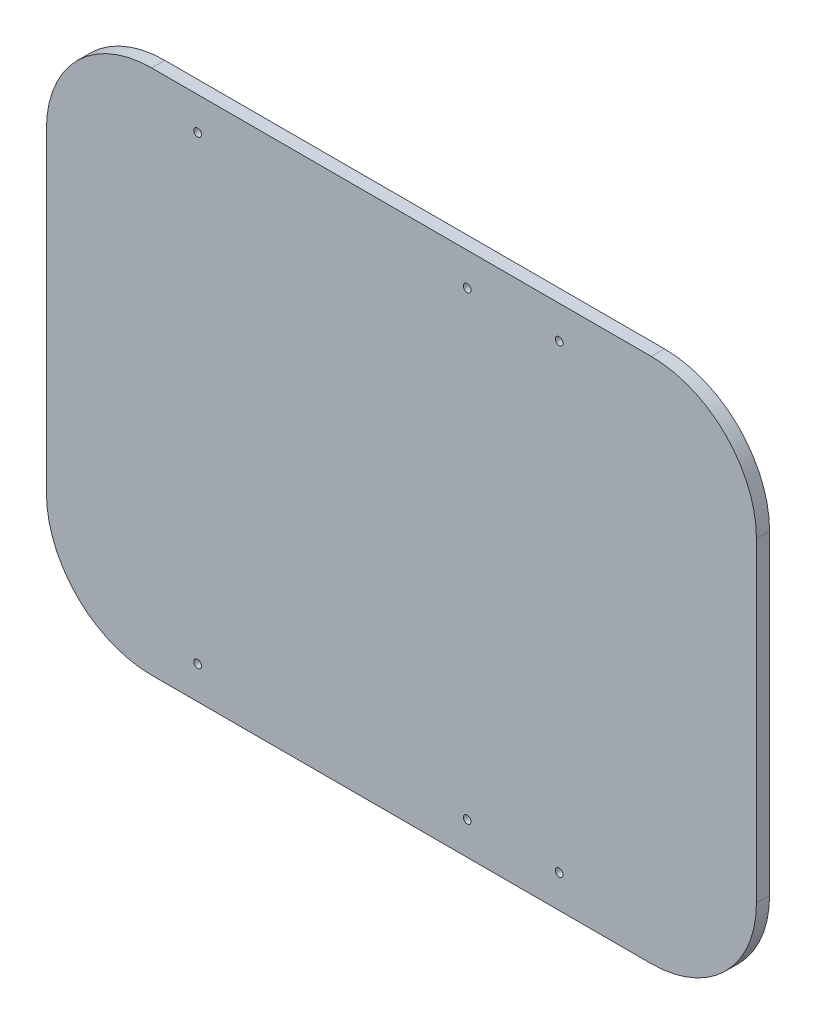
ISO-10303-21;
HEADER;
FILE_DESCRIPTION(('STEP AP214'),'2;1');
FILE_NAME('part.step','',(''),(''),'','','');
FILE_SCHEMA(('AUTOMOTIVE_DESIGN { 1 0 10303 214 1 1 1 1 }'));
ENDSEC;
DATA;
#1=APPLICATION_CONTEXT('core data for automotive mechanical design processes');
#2=APPLICATION_PROTOCOL_DEFINITION('international standard','automotive_design',2000,#1);
#3=PRODUCT_CONTEXT('',#1,'mechanical');
#4=PRODUCT('Part','Part','',(#3));
#5=PRODUCT_RELATED_PRODUCT_CATEGORY('part','',(#4));
#6=PRODUCT_DEFINITION_FORMATION('','',#4);
#7=PRODUCT_DEFINITION_CONTEXT('part definition',#1,'design');
#8=PRODUCT_DEFINITION('design','',#6,#7);
#9=PRODUCT_DEFINITION_SHAPE('','',#8);
#10=(LENGTH_UNIT() NAMED_UNIT(*) SI_UNIT(.MILLI.,.METRE.));
#11=(NAMED_UNIT(*) PLANE_ANGLE_UNIT() SI_UNIT($,.RADIAN.));
#12=(NAMED_UNIT(*) SI_UNIT($,.STERADIAN.) SOLID_ANGLE_UNIT());
#13=UNCERTAINTY_MEASURE_WITH_UNIT(LENGTH_MEASURE(1.E-05),#10,'distance_accuracy_value','');
#14=(GEOMETRIC_REPRESENTATION_CONTEXT(3) GLOBAL_UNCERTAINTY_ASSIGNED_CONTEXT((#13)) GLOBAL_UNIT_ASSIGNED_CONTEXT((#10,
#11,#12)) REPRESENTATION_CONTEXT('',''));
#15=CARTESIAN_POINT('',(0.,0.,0.));
#16=DIRECTION('',(0.,0.,1.));
#17=DIRECTION('',(1.,0.,0.));
#18=AXIS2_PLACEMENT_3D('',#15,#16,#17);
#19=CARTESIAN_POINT('',(-94.9999999999999,-60.,5.));
#20=DIRECTION('',(0.,0.,-1.));
#21=DIRECTION('',(-1.,0.,0.));
#22=AXIS2_PLACEMENT_3D('',#19,#20,#21);
#23=CYLINDRICAL_SURFACE('',#22,40.);
#24=CARTESIAN_POINT('',(-94.9999999999999,-60.,0.));
#25=DIRECTION('',(0.,0.,1.));
#26=DIRECTION('',(1.,0.,0.));
#27=AXIS2_PLACEMENT_3D('',#24,#25,#26);
#28=CIRCLE('',#27,40.);
#29=CARTESIAN_POINT('',(-135.,-59.9999999999997,0.));
#30=VERTEX_POINT('',#29);
#31=CARTESIAN_POINT('',(-94.9999999999996,-100.,0.));
#32=VERTEX_POINT('',#31);
#33=EDGE_CURVE('E150',#30,#32,#28,.T.);
#34=ORIENTED_EDGE('',*,*,#33,.T.);
#35=DIRECTION('',(0.,0.,-1.));
#36=VECTOR('',#35,1.);
#37=CARTESIAN_POINT('',(-94.9999999999996,-100.,5.));
#38=LINE('',#37,#36);
#39=CARTESIAN_POINT('',(-94.9999999999996,-100.,5.));
#40=VERTEX_POINT('',#39);
#41=EDGE_CURVE('E11',#40,#32,#38,.T.);
#42=ORIENTED_EDGE('',*,*,#41,.F.);
#43=CARTESIAN_POINT('',(-94.9999999999999,-60.,5.));
#44=DIRECTION('',(0.,0.,1.));
#45=DIRECTION('',(1.,0.,0.));
#46=AXIS2_PLACEMENT_3D('',#43,#44,#45);
#47=CIRCLE('',#46,40.);
#48=CARTESIAN_POINT('',(-135.,-59.9999999999997,5.));
#49=VERTEX_POINT('',#48);
#50=EDGE_CURVE('E186',#49,#40,#47,.T.);
#51=ORIENTED_EDGE('',*,*,#50,.F.);
#52=DIRECTION('',(0.,0.,-1.));
#53=VECTOR('',#52,1.);
#54=CARTESIAN_POINT('',(-135.,-59.9999999999997,5.));
#55=LINE('',#54,#53);
#56=EDGE_CURVE('E149',#49,#30,#55,.T.);
#57=ORIENTED_EDGE('',*,*,#56,.T.);
#58=EDGE_LOOP('',(#34,#42,#51,#57));
#59=FACE_BOUND('',#58,.T.);
#60=ADVANCED_FACE('F33',(#59),#23,.T.);
#61=CARTESIAN_POINT('',(0.,-100.,5.));
#62=DIRECTION('',(0.,1.,0.));
#63=DIRECTION('',(0.,0.,1.));
#64=AXIS2_PLACEMENT_3D('',#61,#62,#63);
#65=PLANE('',#64);
#66=DIRECTION('',(1.,0.,0.));
#67=VECTOR('',#66,1.);
#68=CARTESIAN_POINT('',(0.,-100.,0.));
#69=LINE('',#68,#67);
#70=CARTESIAN_POINT('',(94.9999999999998,-100.,0.));
#71=VERTEX_POINT('',#70);
#72=EDGE_CURVE('E153',#32,#71,#69,.T.);
#73=ORIENTED_EDGE('',*,*,#72,.T.);
#74=DIRECTION('',(0.,0.,-1.));
#75=VECTOR('',#74,1.);
#76=CARTESIAN_POINT('',(94.9999999999998,-100.,5.));
#77=LINE('',#76,#75);
#78=CARTESIAN_POINT('',(94.9999999999998,-100.,5.));
#79=VERTEX_POINT('',#78);
#80=EDGE_CURVE('E41',#79,#71,#77,.T.);
#81=ORIENTED_EDGE('',*,*,#80,.F.);
#82=DIRECTION('',(1.,0.,0.));
#83=VECTOR('',#82,1.);
#84=CARTESIAN_POINT('',(0.,-100.,5.));
#85=LINE('',#84,#83);
#86=EDGE_CURVE('E91',#40,#79,#85,.T.);
#87=ORIENTED_EDGE('',*,*,#86,.F.);
#88=ORIENTED_EDGE('',*,*,#41,.T.);
#89=EDGE_LOOP('',(#73,#81,#87,#88));
#90=FACE_BOUND('',#89,.T.);
#91=ADVANCED_FACE('F199',(#90),#65,.F.);
#92=CARTESIAN_POINT('',(95.0000000000001,-60.,5.));
#93=DIRECTION('',(0.,0.,-1.));
#94=DIRECTION('',(-1.,0.,0.));
#95=AXIS2_PLACEMENT_3D('',#92,#93,#94);
#96=CYLINDRICAL_SURFACE('',#95,40.);
#97=CARTESIAN_POINT('',(95.0000000000001,-60.,0.));
#98=DIRECTION('',(0.,0.,1.));
#99=DIRECTION('',(1.,0.,0.));
#100=AXIS2_PLACEMENT_3D('',#97,#98,#99);
#101=CIRCLE('',#100,40.);
#102=CARTESIAN_POINT('',(135.,-59.9999999999997,0.));
#103=VERTEX_POINT('',#102);
#104=EDGE_CURVE('E156',#103,#71,#101,.F.);
#105=ORIENTED_EDGE('',*,*,#104,.F.);
#106=DIRECTION('',(0.,0.,-1.));
#107=VECTOR('',#106,1.);
#108=CARTESIAN_POINT('',(135.,-59.9999999999997,5.));
#109=LINE('',#108,#107);
#110=CARTESIAN_POINT('',(135.,-59.9999999999997,5.));
#111=VERTEX_POINT('',#110);
#112=EDGE_CURVE('E192',#111,#103,#109,.T.);
#113=ORIENTED_EDGE('',*,*,#112,.F.);
#114=CARTESIAN_POINT('',(95.0000000000001,-60.,5.));
#115=DIRECTION('',(0.,0.,1.));
#116=DIRECTION('',(1.,0.,0.));
#117=AXIS2_PLACEMENT_3D('',#114,#115,#116);
#118=CIRCLE('',#117,40.);
#119=EDGE_CURVE('E198',#111,#79,#118,.F.);
#120=ORIENTED_EDGE('',*,*,#119,.T.);
#121=ORIENTED_EDGE('',*,*,#80,.T.);
#122=EDGE_LOOP('',(#105,#113,#120,#121));
#123=FACE_BOUND('',#122,.T.);
#124=ADVANCED_FACE('F196',(#123),#96,.T.);
#125=CARTESIAN_POINT('',(135.,0.,5.));
#126=DIRECTION('',(1.,0.,0.));
#127=DIRECTION('',(0.,0.,-1.));
#128=AXIS2_PLACEMENT_3D('',#125,#126,#127);
#129=PLANE('',#128);
#130=DIRECTION('',(0.,-1.,0.));
#131=VECTOR('',#130,1.);
#132=CARTESIAN_POINT('',(135.,0.,0.));
#133=LINE('',#132,#131);
#134=CARTESIAN_POINT('',(135.,59.9999999999998,0.));
#135=VERTEX_POINT('',#134);
#136=EDGE_CURVE('E159',#135,#103,#133,.T.);
#137=ORIENTED_EDGE('',*,*,#136,.F.);
#138=DIRECTION('',(0.,0.,-1.));
#139=VECTOR('',#138,1.);
#140=CARTESIAN_POINT('',(135.,59.9999999999998,5.));
#141=LINE('',#140,#139);
#142=CARTESIAN_POINT('',(135.,59.9999999999998,5.));
#143=VERTEX_POINT('',#142);
#144=EDGE_CURVE('E190',#143,#135,#141,.T.);
#145=ORIENTED_EDGE('',*,*,#144,.F.);
#146=DIRECTION('',(0.,-1.,0.));
#147=VECTOR('',#146,1.);
#148=CARTESIAN_POINT('',(135.,0.,5.));
#149=LINE('',#148,#147);
#150=EDGE_CURVE('E126',#143,#111,#149,.T.);
#151=ORIENTED_EDGE('',*,*,#150,.T.);
#152=ORIENTED_EDGE('',*,*,#112,.T.);
#153=EDGE_LOOP('',(#137,#145,#151,#152));
#154=FACE_BOUND('',#153,.T.);
#155=ADVANCED_FACE('F208',(#154),#129,.T.);
#156=CARTESIAN_POINT('',(95.0000000000001,60.,5.));
#157=DIRECTION('',(0.,0.,-1.));
#158=DIRECTION('',(-1.,0.,0.));
#159=AXIS2_PLACEMENT_3D('',#156,#157,#158);
#160=CYLINDRICAL_SURFACE('',#159,40.);
#161=CARTESIAN_POINT('',(95.0000000000001,60.,0.));
#162=DIRECTION('',(0.,0.,1.));
#163=DIRECTION('',(1.,0.,0.));
#164=AXIS2_PLACEMENT_3D('',#161,#162,#163);
#165=CIRCLE('',#164,40.);
#166=CARTESIAN_POINT('',(94.9999999999998,100.,0.));
#167=VERTEX_POINT('',#166);
#168=EDGE_CURVE('E162',#135,#167,#165,.T.);
#169=ORIENTED_EDGE('',*,*,#168,.T.);
#170=DIRECTION('',(0.,0.,-1.));
#171=VECTOR('',#170,1.);
#172=CARTESIAN_POINT('',(94.9999999999998,100.,5.));
#173=LINE('',#172,#171);
#174=CARTESIAN_POINT('',(94.9999999999998,100.,5.));
#175=VERTEX_POINT('',#174);
#176=EDGE_CURVE('E113',#175,#167,#173,.T.);
#177=ORIENTED_EDGE('',*,*,#176,.F.);
#178=CARTESIAN_POINT('',(95.0000000000001,60.,5.));
#179=DIRECTION('',(0.,0.,1.));
#180=DIRECTION('',(1.,0.,0.));
#181=AXIS2_PLACEMENT_3D('',#178,#179,#180);
#182=CIRCLE('',#181,40.);
#183=EDGE_CURVE('E123',#143,#175,#182,.T.);
#184=ORIENTED_EDGE('',*,*,#183,.F.);
#185=ORIENTED_EDGE('',*,*,#144,.T.);
#186=EDGE_LOOP('',(#169,#177,#184,#185));
#187=FACE_BOUND('',#186,.T.);
#188=ADVANCED_FACE('F241',(#187),#160,.T.);
#189=CARTESIAN_POINT('',(0.,100.,5.));
#190=DIRECTION('',(0.,1.,0.));
#191=DIRECTION('',(0.,0.,1.));
#192=AXIS2_PLACEMENT_3D('',#189,#190,#191);
#193=PLANE('',#192);
#194=DIRECTION('',(1.,0.,0.));
#195=VECTOR('',#194,1.);
#196=CARTESIAN_POINT('',(0.,100.,0.));
#197=LINE('',#196,#195);
#198=CARTESIAN_POINT('',(-94.9999999999996,100.,0.));
#199=VERTEX_POINT('',#198);
#200=EDGE_CURVE('E112',#199,#167,#197,.T.);
#201=ORIENTED_EDGE('',*,*,#200,.F.);
#202=DIRECTION('',(0.,0.,-1.));
#203=VECTOR('',#202,1.);
#204=CARTESIAN_POINT('',(-94.9999999999996,100.,5.));
#205=LINE('',#204,#203);
#206=CARTESIAN_POINT('',(-94.9999999999996,100.,5.));
#207=VERTEX_POINT('',#206);
#208=EDGE_CURVE('E106',#207,#199,#205,.T.);
#209=ORIENTED_EDGE('',*,*,#208,.F.);
#210=DIRECTION('',(1.,0.,0.));
#211=VECTOR('',#210,1.);
#212=CARTESIAN_POINT('',(0.,100.,5.));
#213=LINE('',#212,#211);
#214=EDGE_CURVE('E110',#207,#175,#213,.T.);
#215=ORIENTED_EDGE('',*,*,#214,.T.);
#216=ORIENTED_EDGE('',*,*,#176,.T.);
#217=EDGE_LOOP('',(#201,#209,#215,#216));
#218=FACE_BOUND('',#217,.T.);
#219=ADVANCED_FACE('F108',(#218),#193,.T.);
#220=CARTESIAN_POINT('',(-94.9999999999999,60.,5.));
#221=DIRECTION('',(0.,0.,-1.));
#222=DIRECTION('',(-1.,0.,0.));
#223=AXIS2_PLACEMENT_3D('',#220,#221,#222);
#224=CYLINDRICAL_SURFACE('',#223,40.);
#225=CARTESIAN_POINT('',(-94.9999999999999,60.,0.));
#226=DIRECTION('',(0.,0.,1.));
#227=DIRECTION('',(1.,0.,0.));
#228=AXIS2_PLACEMENT_3D('',#225,#226,#227);
#229=CIRCLE('',#228,40.);
#230=CARTESIAN_POINT('',(-135.,59.9999999999998,0.));
#231=VERTEX_POINT('',#230);
#232=EDGE_CURVE('E77',#199,#231,#229,.T.);
#233=ORIENTED_EDGE('',*,*,#232,.T.);
#234=DIRECTION('',(0.,0.,-1.));
#235=VECTOR('',#234,1.);
#236=CARTESIAN_POINT('',(-135.,59.9999999999998,5.));
#237=LINE('',#236,#235);
#238=CARTESIAN_POINT('',(-135.,59.9999999999998,5.));
#239=VERTEX_POINT('',#238);
#240=EDGE_CURVE('E114',#239,#231,#237,.T.);
#241=ORIENTED_EDGE('',*,*,#240,.F.);
#242=CARTESIAN_POINT('',(-94.9999999999999,60.,5.));
#243=DIRECTION('',(0.,0.,1.));
#244=DIRECTION('',(1.,0.,0.));
#245=AXIS2_PLACEMENT_3D('',#242,#243,#244);
#246=CIRCLE('',#245,40.);
#247=EDGE_CURVE('E116',#207,#239,#246,.T.);
#248=ORIENTED_EDGE('',*,*,#247,.F.);
#249=ORIENTED_EDGE('',*,*,#208,.T.);
#250=EDGE_LOOP('',(#233,#241,#248,#249));
#251=FACE_BOUND('',#250,.T.);
#252=ADVANCED_FACE('F117',(#251),#224,.T.);
#253=CARTESIAN_POINT('',(25.0000000000001,87.5,5.));
#254=DIRECTION('',(0.,0.,-1.));
#255=DIRECTION('',(-1.,0.,0.));
#256=AXIS2_PLACEMENT_3D('',#253,#254,#255);
#257=CYLINDRICAL_SURFACE('',#256,1.475);
#258=CARTESIAN_POINT('',(25.0000000000001,87.5,5.));
#259=DIRECTION('',(0.,0.,1.));
#260=DIRECTION('',(1.,0.,0.));
#261=AXIS2_PLACEMENT_3D('',#258,#259,#260);
#262=CIRCLE('',#261,1.475);
#263=CARTESIAN_POINT('',(26.4750000000001,87.5,5.));
#264=VERTEX_POINT('',#263);
#265=EDGE_CURVE('E143',#264,#264,#262,.T.);
#266=ORIENTED_EDGE('',*,*,#265,.T.);
#267=EDGE_LOOP('',(#266));
#268=FACE_BOUND('',#267,.T.);
#269=CARTESIAN_POINT('',(25.0000000000001,87.5,0.));
#270=DIRECTION('',(0.,0.,1.));
#271=DIRECTION('',(1.,0.,0.));
#272=AXIS2_PLACEMENT_3D('',#269,#270,#271);
#273=CIRCLE('',#272,1.475);
#274=CARTESIAN_POINT('',(26.4750000000001,87.5,0.));
#275=VERTEX_POINT('',#274);
#276=EDGE_CURVE('E180',#275,#275,#273,.T.);
#277=ORIENTED_EDGE('',*,*,#276,.F.);
#278=EDGE_LOOP('',(#277));
#279=FACE_BOUND('',#278,.T.);
#280=ADVANCED_FACE('F247',(#268,#279),#257,.F.);
#281=CARTESIAN_POINT('',(60.0000000000001,87.5,5.));
#282=DIRECTION('',(0.,0.,-1.));
#283=DIRECTION('',(-1.,0.,0.));
#284=AXIS2_PLACEMENT_3D('',#281,#282,#283);
#285=CYLINDRICAL_SURFACE('',#284,1.47500000000001);
#286=CARTESIAN_POINT('',(60.0000000000001,87.5,5.));
#287=DIRECTION('',(0.,0.,1.));
#288=DIRECTION('',(1.,0.,0.));
#289=AXIS2_PLACEMENT_3D('',#286,#287,#288);
#290=CIRCLE('',#289,1.47500000000001);
#291=CARTESIAN_POINT('',(61.4750000000001,87.5,5.));
#292=VERTEX_POINT('',#291);
#293=EDGE_CURVE('E140',#292,#292,#290,.T.);
#294=ORIENTED_EDGE('',*,*,#293,.T.);
#295=EDGE_LOOP('',(#294));
#296=FACE_BOUND('',#295,.T.);
#297=CARTESIAN_POINT('',(60.0000000000001,87.5,0.));
#298=DIRECTION('',(0.,0.,1.));
#299=DIRECTION('',(1.,0.,0.));
#300=AXIS2_PLACEMENT_3D('',#297,#298,#299);
#301=CIRCLE('',#300,1.47500000000001);
#302=CARTESIAN_POINT('',(61.4750000000001,87.5,0.));
#303=VERTEX_POINT('',#302);
#304=EDGE_CURVE('E177',#303,#303,#301,.T.);
#305=ORIENTED_EDGE('',*,*,#304,.F.);
#306=EDGE_LOOP('',(#305));
#307=FACE_BOUND('',#306,.T.);
#308=ADVANCED_FACE('F251',(#296,#307),#285,.F.);
#309=CARTESIAN_POINT('',(60.0000000000001,-87.5,5.));
#310=DIRECTION('',(0.,0.,-1.));
#311=DIRECTION('',(-1.,0.,0.));
#312=AXIS2_PLACEMENT_3D('',#309,#310,#311);
#313=CYLINDRICAL_SURFACE('',#312,1.47500000000001);
#314=CARTESIAN_POINT('',(60.0000000000001,-87.5,5.));
#315=DIRECTION('',(0.,0.,1.));
#316=DIRECTION('',(1.,0.,0.));
#317=AXIS2_PLACEMENT_3D('',#314,#315,#316);
#318=CIRCLE('',#317,1.47500000000001);
#319=CARTESIAN_POINT('',(61.4750000000001,-87.5,5.));
#320=VERTEX_POINT('',#319);
#321=EDGE_CURVE('E137',#320,#320,#318,.F.);
#322=ORIENTED_EDGE('',*,*,#321,.F.);
#323=EDGE_LOOP('',(#322));
#324=FACE_BOUND('',#323,.T.);
#325=CARTESIAN_POINT('',(60.0000000000001,-87.5,0.));
#326=DIRECTION('',(0.,0.,1.));
#327=DIRECTION('',(1.,0.,0.));
#328=AXIS2_PLACEMENT_3D('',#325,#326,#327);
#329=CIRCLE('',#328,1.47500000000001);
#330=CARTESIAN_POINT('',(61.4750000000001,-87.5,0.));
#331=VERTEX_POINT('',#330);
#332=EDGE_CURVE('E174',#331,#331,#329,.F.);
#333=ORIENTED_EDGE('',*,*,#332,.T.);
#334=EDGE_LOOP('',(#333));
#335=FACE_BOUND('',#334,.T.);
#336=ADVANCED_FACE('F257',(#324,#335),#313,.F.);
#337=CARTESIAN_POINT('',(25.0000000000001,-87.5,5.));
#338=DIRECTION('',(0.,0.,-1.));
#339=DIRECTION('',(-1.,0.,0.));
#340=AXIS2_PLACEMENT_3D('',#337,#338,#339);
#341=CYLINDRICAL_SURFACE('',#340,1.475);
#342=CARTESIAN_POINT('',(25.0000000000001,-87.5,5.));
#343=DIRECTION('',(0.,0.,1.));
#344=DIRECTION('',(1.,0.,0.));
#345=AXIS2_PLACEMENT_3D('',#342,#343,#344);
#346=CIRCLE('',#345,1.475);
#347=CARTESIAN_POINT('',(26.4750000000001,-87.5,5.));
#348=VERTEX_POINT('',#347);
#349=EDGE_CURVE('E134',#348,#348,#346,.F.);
#350=ORIENTED_EDGE('',*,*,#349,.F.);
#351=EDGE_LOOP('',(#350));
#352=FACE_BOUND('',#351,.T.);
#353=CARTESIAN_POINT('',(25.0000000000001,-87.5,0.));
#354=DIRECTION('',(0.,0.,1.));
#355=DIRECTION('',(1.,0.,0.));
#356=AXIS2_PLACEMENT_3D('',#353,#354,#355);
#357=CIRCLE('',#356,1.475);
#358=CARTESIAN_POINT('',(26.4750000000001,-87.5,0.));
#359=VERTEX_POINT('',#358);
#360=EDGE_CURVE('E171',#359,#359,#357,.F.);
#361=ORIENTED_EDGE('',*,*,#360,.T.);
#362=EDGE_LOOP('',(#361));
#363=FACE_BOUND('',#362,.T.);
#364=ADVANCED_FACE('F226',(#352,#363),#341,.F.);
#365=CARTESIAN_POINT('',(-77.4999999999999,-87.5,5.));
#366=DIRECTION('',(0.,0.,-1.));
#367=DIRECTION('',(-1.,0.,0.));
#368=AXIS2_PLACEMENT_3D('',#365,#366,#367);
#369=CYLINDRICAL_SURFACE('',#368,1.475);
#370=CARTESIAN_POINT('',(-77.4999999999999,-87.5,5.));
#371=DIRECTION('',(0.,0.,1.));
#372=DIRECTION('',(1.,0.,0.));
#373=AXIS2_PLACEMENT_3D('',#370,#371,#372);
#374=CIRCLE('',#373,1.475);
#375=CARTESIAN_POINT('',(-76.0249999999999,-87.5,5.));
#376=VERTEX_POINT('',#375);
#377=EDGE_CURVE('E131',#376,#376,#374,.F.);
#378=ORIENTED_EDGE('',*,*,#377,.F.);
#379=EDGE_LOOP('',(#378));
#380=FACE_BOUND('',#379,.T.);
#381=CARTESIAN_POINT('',(-77.4999999999999,-87.5,0.));
#382=DIRECTION('',(0.,0.,1.));
#383=DIRECTION('',(1.,0.,0.));
#384=AXIS2_PLACEMENT_3D('',#381,#382,#383);
#385=CIRCLE('',#384,1.475);
#386=CARTESIAN_POINT('',(-76.0249999999999,-87.5,0.));
#387=VERTEX_POINT('',#386);
#388=EDGE_CURVE('E168',#387,#387,#385,.F.);
#389=ORIENTED_EDGE('',*,*,#388,.T.);
#390=EDGE_LOOP('',(#389));
#391=FACE_BOUND('',#390,.T.);
#392=ADVANCED_FACE('F218',(#380,#391),#369,.F.);
#393=CARTESIAN_POINT('',(-135.,0.,5.));
#394=DIRECTION('',(1.,0.,0.));
#395=DIRECTION('',(0.,1.,0.));
#396=AXIS2_PLACEMENT_3D('',#393,#394,#395);
#397=PLANE('',#396);
#398=DIRECTION('',(0.,-1.,0.));
#399=VECTOR('',#398,1.);
#400=CARTESIAN_POINT('',(-135.,0.,0.));
#401=LINE('',#400,#399);
#402=EDGE_CURVE('E83',#231,#30,#401,.T.);
#403=ORIENTED_EDGE('',*,*,#402,.T.);
#404=ORIENTED_EDGE('',*,*,#56,.F.);
#405=DIRECTION('',(0.,-1.,0.));
#406=VECTOR('',#405,1.);
#407=CARTESIAN_POINT('',(-135.,0.,5.));
#408=LINE('',#407,#406);
#409=EDGE_CURVE('E49',#239,#49,#408,.T.);
#410=ORIENTED_EDGE('',*,*,#409,.F.);
#411=ORIENTED_EDGE('',*,*,#240,.T.);
#412=EDGE_LOOP('',(#403,#404,#410,#411));
#413=FACE_BOUND('',#412,.T.);
#414=ADVANCED_FACE('F215',(#413),#397,.F.);
#415=CARTESIAN_POINT('',(-77.4999999999999,87.5,5.));
#416=DIRECTION('',(0.,0.,-1.));
#417=DIRECTION('',(-1.,0.,0.));
#418=AXIS2_PLACEMENT_3D('',#415,#416,#417);
#419=CYLINDRICAL_SURFACE('',#418,1.475);
#420=CARTESIAN_POINT('',(-77.4999999999999,87.5,5.));
#421=DIRECTION('',(0.,0.,1.));
#422=DIRECTION('',(1.,0.,0.));
#423=AXIS2_PLACEMENT_3D('',#420,#421,#422);
#424=CIRCLE('',#423,1.475);
#425=CARTESIAN_POINT('',(-76.0249999999999,87.5,5.));
#426=VERTEX_POINT('',#425);
#427=EDGE_CURVE('E146',#426,#426,#424,.T.);
#428=ORIENTED_EDGE('',*,*,#427,.T.);
#429=EDGE_LOOP('',(#428));
#430=FACE_BOUND('',#429,.T.);
#431=CARTESIAN_POINT('',(-77.4999999999999,87.5,0.));
#432=DIRECTION('',(0.,0.,1.));
#433=DIRECTION('',(1.,0.,0.));
#434=AXIS2_PLACEMENT_3D('',#431,#432,#433);
#435=CIRCLE('',#434,1.475);
#436=CARTESIAN_POINT('',(-76.0249999999999,87.5,0.));
#437=VERTEX_POINT('',#436);
#438=EDGE_CURVE('E183',#437,#437,#435,.T.);
#439=ORIENTED_EDGE('',*,*,#438,.F.);
#440=EDGE_LOOP('',(#439));
#441=FACE_BOUND('',#440,.T.);
#442=ADVANCED_FACE('F217',(#430,#441),#419,.F.);
#443=CARTESIAN_POINT('',(0.,0.,5.));
#444=DIRECTION('',(0.,0.,1.));
#445=DIRECTION('',(1.,0.,0.));
#446=AXIS2_PLACEMENT_3D('',#443,#444,#445);
#447=PLANE('',#446);
#448=ORIENTED_EDGE('',*,*,#50,.T.);
#449=ORIENTED_EDGE('',*,*,#86,.T.);
#450=ORIENTED_EDGE('',*,*,#119,.F.);
#451=ORIENTED_EDGE('',*,*,#150,.F.);
#452=ORIENTED_EDGE('',*,*,#183,.T.);
#453=ORIENTED_EDGE('',*,*,#214,.F.);
#454=ORIENTED_EDGE('',*,*,#247,.T.);
#455=ORIENTED_EDGE('',*,*,#409,.T.);
#456=EDGE_LOOP('',(#448,#449,#450,#451,#452,#453,#454,#455));
#457=FACE_BOUND('',#456,.T.);
#458=ORIENTED_EDGE('',*,*,#377,.T.);
#459=EDGE_LOOP('',(#458));
#460=FACE_BOUND('',#459,.T.);
#461=ORIENTED_EDGE('',*,*,#349,.T.);
#462=EDGE_LOOP('',(#461));
#463=FACE_BOUND('',#462,.T.);
#464=ORIENTED_EDGE('',*,*,#321,.T.);
#465=EDGE_LOOP('',(#464));
#466=FACE_BOUND('',#465,.T.);
#467=ORIENTED_EDGE('',*,*,#293,.F.);
#468=EDGE_LOOP('',(#467));
#469=FACE_BOUND('',#468,.T.);
#470=ORIENTED_EDGE('',*,*,#265,.F.);
#471=EDGE_LOOP('',(#470));
#472=FACE_BOUND('',#471,.T.);
#473=ORIENTED_EDGE('',*,*,#427,.F.);
#474=EDGE_LOOP('',(#473));
#475=FACE_BOUND('',#474,.T.);
#476=ADVANCED_FACE('F119',(#457,#460,#463,#466,#469,#472,#475),#447,.T.);
#477=CARTESIAN_POINT('',(0.,0.,0.));
#478=DIRECTION('',(0.,0.,1.));
#479=DIRECTION('',(1.,0.,0.));
#480=AXIS2_PLACEMENT_3D('',#477,#478,#479);
#481=PLANE('',#480);
#482=ORIENTED_EDGE('',*,*,#33,.F.);
#483=ORIENTED_EDGE('',*,*,#402,.F.);
#484=ORIENTED_EDGE('',*,*,#232,.F.);
#485=ORIENTED_EDGE('',*,*,#200,.T.);
#486=ORIENTED_EDGE('',*,*,#168,.F.);
#487=ORIENTED_EDGE('',*,*,#136,.T.);
#488=ORIENTED_EDGE('',*,*,#104,.T.);
#489=ORIENTED_EDGE('',*,*,#72,.F.);
#490=EDGE_LOOP('',(#482,#483,#484,#485,#486,#487,#488,#489));
#491=FACE_BOUND('',#490,.T.);
#492=ORIENTED_EDGE('',*,*,#388,.F.);
#493=EDGE_LOOP('',(#492));
#494=FACE_BOUND('',#493,.T.);
#495=ORIENTED_EDGE('',*,*,#360,.F.);
#496=EDGE_LOOP('',(#495));
#497=FACE_BOUND('',#496,.T.);
#498=ORIENTED_EDGE('',*,*,#332,.F.);
#499=EDGE_LOOP('',(#498));
#500=FACE_BOUND('',#499,.T.);
#501=ORIENTED_EDGE('',*,*,#304,.T.);
#502=EDGE_LOOP('',(#501));
#503=FACE_BOUND('',#502,.T.);
#504=ORIENTED_EDGE('',*,*,#276,.T.);
#505=EDGE_LOOP('',(#504));
#506=FACE_BOUND('',#505,.T.);
#507=ORIENTED_EDGE('',*,*,#438,.T.);
#508=EDGE_LOOP('',(#507));
#509=FACE_BOUND('',#508,.T.);
#510=ADVANCED_FACE('F203',(#491,#494,#497,#500,#503,#506,#509),#481,.F.);
#511=CLOSED_SHELL('',(#60,#91,#124,#155,#188,#219,#252,#280,#308,#336,#364,#392,#414,#442,#476,#510));
#512=MANIFOLD_SOLID_BREP('B2',#511);
#513=ADVANCED_BREP_SHAPE_REPRESENTATION('',(#18,#512),#14);
#514=SHAPE_DEFINITION_REPRESENTATION(#9,#513);
ENDSEC;
END-ISO-10303-21;
